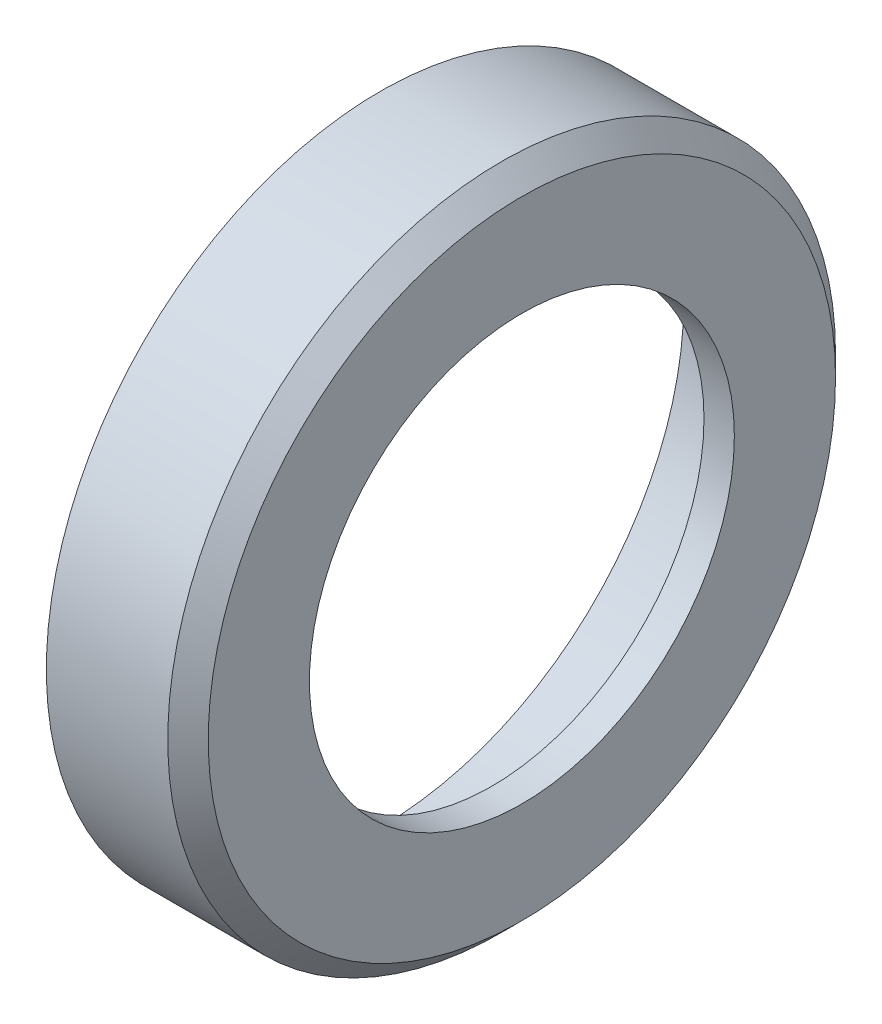
ISO-10303-21;
HEADER;
FILE_DESCRIPTION(('STEP AP214'),'2;1');
FILE_NAME('part.step','',(''),(''),'','','');
FILE_SCHEMA(('AUTOMOTIVE_DESIGN { 1 0 10303 214 1 1 1 1 }'));
ENDSEC;
DATA;
#1=APPLICATION_CONTEXT('core data for automotive mechanical design processes');
#2=APPLICATION_PROTOCOL_DEFINITION('international standard','automotive_design',2000,#1);
#3=PRODUCT_CONTEXT('',#1,'mechanical');
#4=PRODUCT('Part','Part','',(#3));
#5=PRODUCT_RELATED_PRODUCT_CATEGORY('part','',(#4));
#6=PRODUCT_DEFINITION_FORMATION('','',#4);
#7=PRODUCT_DEFINITION_CONTEXT('part definition',#1,'design');
#8=PRODUCT_DEFINITION('design','',#6,#7);
#9=PRODUCT_DEFINITION_SHAPE('','',#8);
#10=(LENGTH_UNIT() NAMED_UNIT(*) SI_UNIT(.MILLI.,.METRE.));
#11=(NAMED_UNIT(*) PLANE_ANGLE_UNIT() SI_UNIT($,.RADIAN.));
#12=(NAMED_UNIT(*) SI_UNIT($,.STERADIAN.) SOLID_ANGLE_UNIT());
#13=UNCERTAINTY_MEASURE_WITH_UNIT(LENGTH_MEASURE(1.E-05),#10,'distance_accuracy_value','');
#14=(GEOMETRIC_REPRESENTATION_CONTEXT(3) GLOBAL_UNCERTAINTY_ASSIGNED_CONTEXT((#13)) GLOBAL_UNIT_ASSIGNED_CONTEXT((#10,
#11,#12)) REPRESENTATION_CONTEXT('',''));
#15=CARTESIAN_POINT('',(0.,0.,0.));
#16=DIRECTION('',(0.,0.,1.));
#17=DIRECTION('',(1.,0.,0.));
#18=AXIS2_PLACEMENT_3D('',#15,#16,#17);
#19=CARTESIAN_POINT('',(0.,0.,0.));
#20=DIRECTION('',(-1.,0.,0.));
#21=DIRECTION('',(0.,0.,1.));
#22=AXIS2_PLACEMENT_3D('',#19,#20,#21);
#23=CONICAL_SURFACE('',#22,15.5,0.785398163397449);
#24=CARTESIAN_POINT('',(-1.,0.,0.));
#25=DIRECTION('',(1.,0.,0.));
#26=DIRECTION('',(0.,0.,-1.));
#27=AXIS2_PLACEMENT_3D('',#24,#25,#26);
#28=CIRCLE('',#27,16.5);
#29=CARTESIAN_POINT('',(-1.,0.,-16.5));
#30=VERTEX_POINT('',#29);
#31=EDGE_CURVE('E97',#30,#30,#28,.T.);
#32=ORIENTED_EDGE('',*,*,#31,.T.);
#33=EDGE_LOOP('',(#32));
#34=FACE_BOUND('',#33,.T.);
#35=CARTESIAN_POINT('',(0.,0.,0.));
#36=DIRECTION('',(1.,0.,0.));
#37=DIRECTION('',(0.,0.,-1.));
#38=AXIS2_PLACEMENT_3D('',#35,#36,#37);
#39=CIRCLE('',#38,15.5);
#40=CARTESIAN_POINT('',(0.,0.,-15.5));
#41=VERTEX_POINT('',#40);
#42=EDGE_CURVE('E83',#41,#41,#39,.T.);
#43=ORIENTED_EDGE('',*,*,#42,.F.);
#44=EDGE_LOOP('',(#43));
#45=FACE_BOUND('',#44,.T.);
#46=ADVANCED_FACE('F36',(#34,#45),#23,.T.);
#47=CARTESIAN_POINT('',(0.,0.,0.));
#48=DIRECTION('',(1.,0.,0.));
#49=DIRECTION('',(0.,0.,-1.));
#50=AXIS2_PLACEMENT_3D('',#47,#48,#49);
#51=CYLINDRICAL_SURFACE('',#50,16.5);
#52=DIRECTION('',(1.,0.,0.));
#53=VECTOR('',#52,1.);
#54=CARTESIAN_POINT('',(0.,-16.4696690920006,-1.));
#55=LINE('',#54,#53);
#56=CARTESIAN_POINT('',(-7.,-16.4696690920006,-1.));
#57=VERTEX_POINT('',#56);
#58=CARTESIAN_POINT('',(-5.,-16.4696690920006,-1.));
#59=VERTEX_POINT('',#58);
#60=EDGE_CURVE('E57',#57,#59,#55,.T.);
#61=ORIENTED_EDGE('',*,*,#60,.F.);
#62=CARTESIAN_POINT('',(-7.,0.,0.));
#63=DIRECTION('',(1.,0.,0.));
#64=DIRECTION('',(0.,0.,-1.));
#65=AXIS2_PLACEMENT_3D('',#62,#63,#64);
#66=CIRCLE('',#65,16.5);
#67=CARTESIAN_POINT('',(-7.,-16.4696690920006,1.));
#68=VERTEX_POINT('',#67);
#69=EDGE_CURVE('E90',#57,#68,#66,.T.);
#70=ORIENTED_EDGE('',*,*,#69,.T.);
#71=DIRECTION('',(1.,0.,0.));
#72=VECTOR('',#71,1.);
#73=CARTESIAN_POINT('',(0.,-16.4696690920006,1.));
#74=LINE('',#73,#72);
#75=CARTESIAN_POINT('',(-5.,-16.4696690920006,1.));
#76=VERTEX_POINT('',#75);
#77=EDGE_CURVE('E75',#76,#68,#74,.F.);
#78=ORIENTED_EDGE('',*,*,#77,.F.);
#79=CARTESIAN_POINT('',(-5.,0.,0.));
#80=DIRECTION('',(1.,0.,0.));
#81=DIRECTION('',(0.,0.,-1.));
#82=AXIS2_PLACEMENT_3D('',#79,#80,#81);
#83=CIRCLE('',#82,16.5);
#84=EDGE_CURVE('E115',#59,#76,#83,.F.);
#85=ORIENTED_EDGE('',*,*,#84,.F.);
#86=EDGE_LOOP('',(#61,#70,#78,#85));
#87=FACE_BOUND('',#86,.T.);
#88=ORIENTED_EDGE('',*,*,#31,.F.);
#89=EDGE_LOOP('',(#88));
#90=FACE_BOUND('',#89,.T.);
#91=ADVANCED_FACE('F95',(#87,#90),#51,.T.);
#92=CARTESIAN_POINT('',(-7.,16.5,0.));
#93=DIRECTION('',(-1.,0.,0.));
#94=DIRECTION('',(0.,0.,1.));
#95=AXIS2_PLACEMENT_3D('',#92,#93,#94);
#96=PLANE('',#95);
#97=DIRECTION('',(0.,1.,0.));
#98=VECTOR('',#97,1.);
#99=CARTESIAN_POINT('',(-7.,-8.50462057934953,1.));
#100=LINE('',#99,#98);
#101=CARTESIAN_POINT('',(-7.,-14.9666295470958,1.));
#102=VERTEX_POINT('',#101);
#103=EDGE_CURVE('E78',#68,#102,#100,.T.);
#104=ORIENTED_EDGE('',*,*,#103,.F.);
#105=ORIENTED_EDGE('',*,*,#69,.F.);
#106=DIRECTION('',(0.,-1.,0.));
#107=VECTOR('',#106,1.);
#108=CARTESIAN_POINT('',(-7.,-18.7904448788579,-1.));
#109=LINE('',#108,#107);
#110=CARTESIAN_POINT('',(-7.,-14.9666295470958,-1.));
#111=VERTEX_POINT('',#110);
#112=EDGE_CURVE('E93',#111,#57,#109,.T.);
#113=ORIENTED_EDGE('',*,*,#112,.F.);
#114=CARTESIAN_POINT('',(-7.,0.,0.));
#115=DIRECTION('',(1.,0.,0.));
#116=DIRECTION('',(0.,0.,-1.));
#117=AXIS2_PLACEMENT_3D('',#114,#115,#116);
#118=CIRCLE('',#117,15.);
#119=EDGE_CURVE('E92',#111,#102,#118,.T.);
#120=ORIENTED_EDGE('',*,*,#119,.T.);
#121=EDGE_LOOP('',(#104,#105,#113,#120));
#122=FACE_BOUND('',#121,.T.);
#123=ADVANCED_FACE('F88',(#122),#96,.T.);
#124=CARTESIAN_POINT('',(0.,0.,0.));
#125=DIRECTION('',(1.,0.,0.));
#126=DIRECTION('',(0.,0.,-1.));
#127=AXIS2_PLACEMENT_3D('',#124,#125,#126);
#128=CYLINDRICAL_SURFACE('',#127,15.);
#129=DIRECTION('',(1.,0.,0.));
#130=VECTOR('',#129,1.);
#131=CARTESIAN_POINT('',(0.,-14.9666295470958,1.));
#132=LINE('',#131,#130);
#133=CARTESIAN_POINT('',(-5.,-14.9666295470958,1.));
#134=VERTEX_POINT('',#133);
#135=EDGE_CURVE('E13',#102,#134,#132,.T.);
#136=ORIENTED_EDGE('',*,*,#135,.F.);
#137=ORIENTED_EDGE('',*,*,#119,.F.);
#138=DIRECTION('',(1.,0.,0.));
#139=VECTOR('',#138,1.);
#140=CARTESIAN_POINT('',(0.,-14.9666295470958,-1.));
#141=LINE('',#140,#139);
#142=CARTESIAN_POINT('',(-5.,-14.9666295470958,-1.));
#143=VERTEX_POINT('',#142);
#144=EDGE_CURVE('E43',#143,#111,#141,.F.);
#145=ORIENTED_EDGE('',*,*,#144,.F.);
#146=CARTESIAN_POINT('',(-5.,0.,0.));
#147=DIRECTION('',(1.,0.,0.));
#148=DIRECTION('',(0.,0.,-1.));
#149=AXIS2_PLACEMENT_3D('',#146,#147,#148);
#150=CIRCLE('',#149,15.);
#151=EDGE_CURVE('E100',#134,#143,#150,.T.);
#152=ORIENTED_EDGE('',*,*,#151,.F.);
#153=EDGE_LOOP('',(#136,#137,#145,#152));
#154=FACE_BOUND('',#153,.T.);
#155=CARTESIAN_POINT('',(-3.,0.,0.));
#156=DIRECTION('',(1.,0.,0.));
#157=DIRECTION('',(0.,0.,-1.));
#158=AXIS2_PLACEMENT_3D('',#155,#156,#157);
#159=CIRCLE('',#158,15.);
#160=CARTESIAN_POINT('',(-3.,0.,-15.));
#161=VERTEX_POINT('',#160);
#162=EDGE_CURVE('E102',#161,#161,#159,.T.);
#163=ORIENTED_EDGE('',*,*,#162,.T.);
#164=EDGE_LOOP('',(#163));
#165=FACE_BOUND('',#164,.T.);
#166=ADVANCED_FACE('F112',(#154,#165),#128,.F.);
#167=CARTESIAN_POINT('',(-3.,15.,0.));
#168=DIRECTION('',(1.,0.,0.));
#169=DIRECTION('',(0.,0.,-1.));
#170=AXIS2_PLACEMENT_3D('',#167,#168,#169);
#171=PLANE('',#170);
#172=CARTESIAN_POINT('',(-3.,0.,0.));
#173=DIRECTION('',(1.,0.,0.));
#174=DIRECTION('',(0.,0.,-1.));
#175=AXIS2_PLACEMENT_3D('',#172,#173,#174);
#176=CIRCLE('',#175,15.25);
#177=CARTESIAN_POINT('',(-3.,0.,-15.25));
#178=VERTEX_POINT('',#177);
#179=EDGE_CURVE('E138',#178,#178,#176,.T.);
#180=ORIENTED_EDGE('',*,*,#179,.T.);
#181=EDGE_LOOP('',(#180));
#182=FACE_BOUND('',#181,.T.);
#183=ORIENTED_EDGE('',*,*,#162,.F.);
#184=EDGE_LOOP('',(#183));
#185=FACE_BOUND('',#184,.T.);
#186=ADVANCED_FACE('F143',(#182,#185),#171,.T.);
#187=CARTESIAN_POINT('',(0.,0.,0.));
#188=DIRECTION('',(1.,0.,0.));
#189=DIRECTION('',(0.,0.,-1.));
#190=AXIS2_PLACEMENT_3D('',#187,#188,#189);
#191=CYLINDRICAL_SURFACE('',#190,15.25);
#192=CARTESIAN_POINT('',(-2.,0.,0.));
#193=DIRECTION('',(1.,0.,0.));
#194=DIRECTION('',(0.,0.,-1.));
#195=AXIS2_PLACEMENT_3D('',#192,#193,#194);
#196=CIRCLE('',#195,15.25);
#197=CARTESIAN_POINT('',(-2.,0.,-15.25));
#198=VERTEX_POINT('',#197);
#199=EDGE_CURVE('E135',#198,#198,#196,.T.);
#200=ORIENTED_EDGE('',*,*,#199,.T.);
#201=EDGE_LOOP('',(#200));
#202=FACE_BOUND('',#201,.T.);
#203=ORIENTED_EDGE('',*,*,#179,.F.);
#204=EDGE_LOOP('',(#203));
#205=FACE_BOUND('',#204,.T.);
#206=ADVANCED_FACE('F145',(#202,#205),#191,.F.);
#207=CARTESIAN_POINT('',(-2.,15.25,0.));
#208=DIRECTION('',(-1.,0.,0.));
#209=DIRECTION('',(0.,0.,1.));
#210=AXIS2_PLACEMENT_3D('',#207,#208,#209);
#211=PLANE('',#210);
#212=CARTESIAN_POINT('',(-2.,0.,0.));
#213=DIRECTION('',(1.,0.,0.));
#214=DIRECTION('',(0.,0.,-1.));
#215=AXIS2_PLACEMENT_3D('',#212,#213,#214);
#216=CIRCLE('',#215,13.);
#217=CARTESIAN_POINT('',(-2.,0.,-13.));
#218=VERTEX_POINT('',#217);
#219=EDGE_CURVE('E132',#218,#218,#216,.T.);
#220=ORIENTED_EDGE('',*,*,#219,.T.);
#221=EDGE_LOOP('',(#220));
#222=FACE_BOUND('',#221,.T.);
#223=ORIENTED_EDGE('',*,*,#199,.F.);
#224=EDGE_LOOP('',(#223));
#225=FACE_BOUND('',#224,.T.);
#226=ADVANCED_FACE('F152',(#222,#225),#211,.T.);
#227=CARTESIAN_POINT('',(0.,0.,0.));
#228=DIRECTION('',(1.,0.,0.));
#229=DIRECTION('',(0.,0.,-1.));
#230=AXIS2_PLACEMENT_3D('',#227,#228,#229);
#231=CYLINDRICAL_SURFACE('',#230,13.);
#232=CARTESIAN_POINT('',(-1.5,0.,0.));
#233=DIRECTION('',(1.,0.,0.));
#234=DIRECTION('',(0.,0.,-1.));
#235=AXIS2_PLACEMENT_3D('',#232,#233,#234);
#236=CIRCLE('',#235,13.);
#237=CARTESIAN_POINT('',(-1.5,0.,-13.));
#238=VERTEX_POINT('',#237);
#239=EDGE_CURVE('E129',#238,#238,#236,.T.);
#240=ORIENTED_EDGE('',*,*,#239,.T.);
#241=EDGE_LOOP('',(#240));
#242=FACE_BOUND('',#241,.T.);
#243=ORIENTED_EDGE('',*,*,#219,.F.);
#244=EDGE_LOOP('',(#243));
#245=FACE_BOUND('',#244,.T.);
#246=ADVANCED_FACE('F180',(#242,#245),#231,.F.);
#247=CARTESIAN_POINT('',(-1.5,13.,0.));
#248=DIRECTION('',(-1.,0.,0.));
#249=DIRECTION('',(0.,0.,1.));
#250=AXIS2_PLACEMENT_3D('',#247,#248,#249);
#251=PLANE('',#250);
#252=CARTESIAN_POINT('',(-1.5,0.,0.));
#253=DIRECTION('',(1.,0.,0.));
#254=DIRECTION('',(0.,0.,-1.));
#255=AXIS2_PLACEMENT_3D('',#252,#253,#254);
#256=CIRCLE('',#255,10.5);
#257=CARTESIAN_POINT('',(-1.5,0.,-10.5));
#258=VERTEX_POINT('',#257);
#259=EDGE_CURVE('E126',#258,#258,#256,.T.);
#260=ORIENTED_EDGE('',*,*,#259,.T.);
#261=EDGE_LOOP('',(#260));
#262=FACE_BOUND('',#261,.T.);
#263=ORIENTED_EDGE('',*,*,#239,.F.);
#264=EDGE_LOOP('',(#263));
#265=FACE_BOUND('',#264,.T.);
#266=ADVANCED_FACE('F174',(#262,#265),#251,.T.);
#267=CARTESIAN_POINT('',(0.,0.,0.));
#268=DIRECTION('',(1.,0.,0.));
#269=DIRECTION('',(0.,0.,-1.));
#270=AXIS2_PLACEMENT_3D('',#267,#268,#269);
#271=CYLINDRICAL_SURFACE('',#270,10.5);
#272=CARTESIAN_POINT('',(0.,0.,0.));
#273=DIRECTION('',(1.,0.,0.));
#274=DIRECTION('',(0.,0.,-1.));
#275=AXIS2_PLACEMENT_3D('',#272,#273,#274);
#276=CIRCLE('',#275,10.5);
#277=CARTESIAN_POINT('',(0.,0.,-10.5));
#278=VERTEX_POINT('',#277);
#279=EDGE_CURVE('E123',#278,#278,#276,.T.);
#280=ORIENTED_EDGE('',*,*,#279,.T.);
#281=EDGE_LOOP('',(#280));
#282=FACE_BOUND('',#281,.T.);
#283=ORIENTED_EDGE('',*,*,#259,.F.);
#284=EDGE_LOOP('',(#283));
#285=FACE_BOUND('',#284,.T.);
#286=ADVANCED_FACE('F168',(#282,#285),#271,.F.);
#287=CARTESIAN_POINT('',(0.,10.5,0.));
#288=DIRECTION('',(1.,0.,0.));
#289=DIRECTION('',(0.,0.,-1.));
#290=AXIS2_PLACEMENT_3D('',#287,#288,#289);
#291=PLANE('',#290);
#292=ORIENTED_EDGE('',*,*,#42,.T.);
#293=EDGE_LOOP('',(#292));
#294=FACE_BOUND('',#293,.T.);
#295=ORIENTED_EDGE('',*,*,#279,.F.);
#296=EDGE_LOOP('',(#295));
#297=FACE_BOUND('',#296,.T.);
#298=ADVANCED_FACE('F165',(#294,#297),#291,.T.);
#299=CARTESIAN_POINT('',(-5.,-8.50462057934953,1.));
#300=DIRECTION('',(0.,0.,1.));
#301=DIRECTION('',(0.,-1.,0.));
#302=AXIS2_PLACEMENT_3D('',#299,#300,#301);
#303=PLANE('',#302);
#304=ORIENTED_EDGE('',*,*,#77,.T.);
#305=ORIENTED_EDGE('',*,*,#103,.T.);
#306=ORIENTED_EDGE('',*,*,#135,.T.);
#307=DIRECTION('',(0.,1.,0.));
#308=VECTOR('',#307,1.);
#309=CARTESIAN_POINT('',(-5.,-8.50462057934953,1.));
#310=LINE('',#309,#308);
#311=EDGE_CURVE('E50',#76,#134,#310,.T.);
#312=ORIENTED_EDGE('',*,*,#311,.F.);
#313=EDGE_LOOP('',(#304,#305,#306,#312));
#314=FACE_BOUND('',#313,.T.);
#315=ADVANCED_FACE('F77',(#314),#303,.F.);
#316=CARTESIAN_POINT('',(-5.,-18.7904448788579,-1.));
#317=DIRECTION('',(0.,0.,-1.));
#318=DIRECTION('',(-1.,0.,0.));
#319=AXIS2_PLACEMENT_3D('',#316,#317,#318);
#320=PLANE('',#319);
#321=ORIENTED_EDGE('',*,*,#60,.T.);
#322=DIRECTION('',(0.,-1.,0.));
#323=VECTOR('',#322,1.);
#324=CARTESIAN_POINT('',(-5.,-18.7904448788579,-1.));
#325=LINE('',#324,#323);
#326=EDGE_CURVE('E108',#143,#59,#325,.T.);
#327=ORIENTED_EDGE('',*,*,#326,.F.);
#328=ORIENTED_EDGE('',*,*,#144,.T.);
#329=ORIENTED_EDGE('',*,*,#112,.T.);
#330=EDGE_LOOP('',(#321,#327,#328,#329));
#331=FACE_BOUND('',#330,.T.);
#332=ADVANCED_FACE('F107',(#331),#320,.F.);
#333=CARTESIAN_POINT('',(-5.,-18.7904448788579,1.));
#334=DIRECTION('',(1.,0.,0.));
#335=DIRECTION('',(0.,0.,-1.));
#336=AXIS2_PLACEMENT_3D('',#333,#334,#335);
#337=PLANE('',#336);
#338=ORIENTED_EDGE('',*,*,#84,.T.);
#339=ORIENTED_EDGE('',*,*,#311,.T.);
#340=ORIENTED_EDGE('',*,*,#151,.T.);
#341=ORIENTED_EDGE('',*,*,#326,.T.);
#342=EDGE_LOOP('',(#338,#339,#340,#341));
#343=FACE_BOUND('',#342,.T.);
#344=ADVANCED_FACE('F114',(#343),#337,.F.);
#345=CLOSED_SHELL('',(#46,#91,#123,#166,#186,#206,#226,#246,#266,#286,#298,#315,#332,#344));
#346=MANIFOLD_SOLID_BREP('B2',#345);
#347=ADVANCED_BREP_SHAPE_REPRESENTATION('',(#18,#346),#14);
#348=SHAPE_DEFINITION_REPRESENTATION(#9,#347);
ENDSEC;
END-ISO-10303-21;
